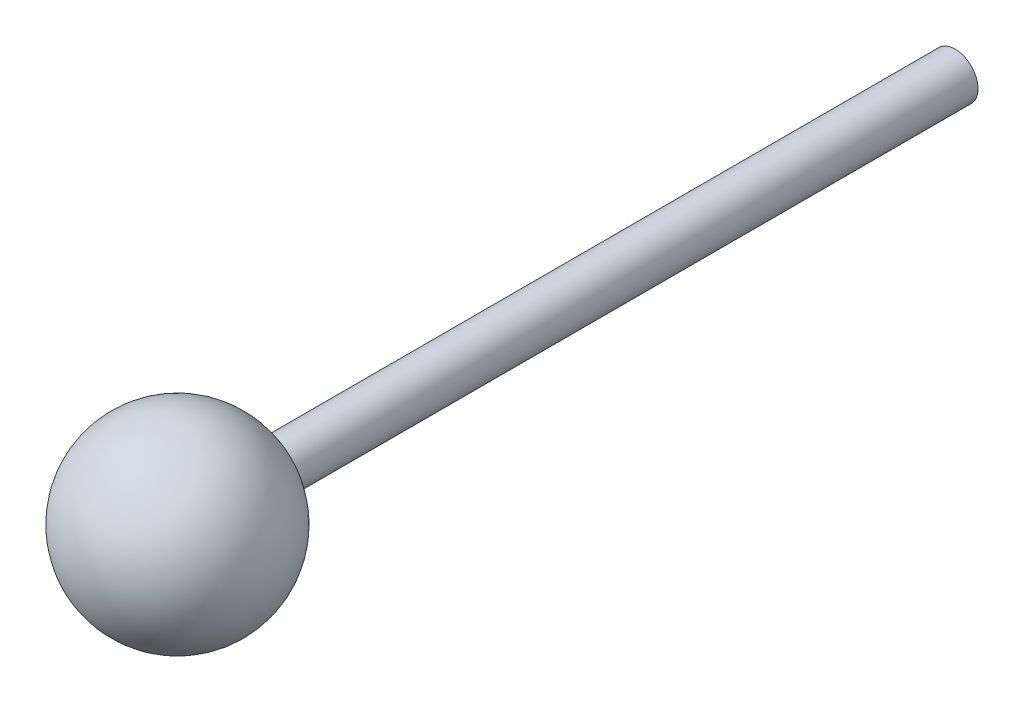
ISO-10303-21;
HEADER;
FILE_DESCRIPTION(('STEP AP214'),'2;1');
FILE_NAME('part.step','',(''),(''),'','','');
FILE_SCHEMA(('AUTOMOTIVE_DESIGN { 1 0 10303 214 1 1 1 1 }'));
ENDSEC;
DATA;
#1=APPLICATION_CONTEXT('core data for automotive mechanical design processes');
#2=APPLICATION_PROTOCOL_DEFINITION('international standard','automotive_design',2000,#1);
#3=PRODUCT_CONTEXT('',#1,'mechanical');
#4=PRODUCT('Part','Part','',(#3));
#5=PRODUCT_RELATED_PRODUCT_CATEGORY('part','',(#4));
#6=PRODUCT_DEFINITION_FORMATION('','',#4);
#7=PRODUCT_DEFINITION_CONTEXT('part definition',#1,'design');
#8=PRODUCT_DEFINITION('design','',#6,#7);
#9=PRODUCT_DEFINITION_SHAPE('','',#8);
#10=(LENGTH_UNIT() NAMED_UNIT(*) SI_UNIT(.MILLI.,.METRE.));
#11=(NAMED_UNIT(*) PLANE_ANGLE_UNIT() SI_UNIT($,.RADIAN.));
#12=(NAMED_UNIT(*) SI_UNIT($,.STERADIAN.) SOLID_ANGLE_UNIT());
#13=UNCERTAINTY_MEASURE_WITH_UNIT(LENGTH_MEASURE(1.E-05),#10,'distance_accuracy_value','');
#14=(GEOMETRIC_REPRESENTATION_CONTEXT(3) GLOBAL_UNCERTAINTY_ASSIGNED_CONTEXT((#13)) GLOBAL_UNIT_ASSIGNED_CONTEXT((#10,
#11,#12)) REPRESENTATION_CONTEXT('',''));
#15=CARTESIAN_POINT('',(0.,0.,0.));
#16=DIRECTION('',(0.,0.,1.));
#17=DIRECTION('',(1.,0.,0.));
#18=AXIS2_PLACEMENT_3D('',#15,#16,#17);
#19=CARTESIAN_POINT('',(67.9041212428615,47.8091782821366,15.));
#20=DIRECTION('',(0.,0.,-1.));
#21=DIRECTION('',(-1.,0.,0.));
#22=AXIS2_PLACEMENT_3D('',#19,#20,#21);
#23=CYLINDRICAL_SURFACE('',#22,0.499999999999999);
#24=CARTESIAN_POINT('',(67.9041212428615,47.8091782821366,15.));
#25=DIRECTION('',(0.,0.,1.));
#26=DIRECTION('',(1.,0.,0.));
#27=AXIS2_PLACEMENT_3D('',#24,#25,#26);
#28=CIRCLE('',#27,0.499999999999999);
#29=CARTESIAN_POINT('',(68.4041212428615,47.8091782821366,15.));
#30=VERTEX_POINT('',#29);
#31=EDGE_CURVE('E10',#30,#30,#28,.T.);
#32=ORIENTED_EDGE('',*,*,#31,.F.);
#33=EDGE_LOOP('',(#32));
#34=FACE_BOUND('',#33,.T.);
#35=CARTESIAN_POINT('',(67.9041212428615,47.8091782821366,0.));
#36=DIRECTION('',(0.,0.,1.));
#37=DIRECTION('',(1.,0.,0.));
#38=AXIS2_PLACEMENT_3D('',#35,#36,#37);
#39=CIRCLE('',#38,0.499999999999999);
#40=CARTESIAN_POINT('',(68.4041212428615,47.8091782821366,0.));
#41=VERTEX_POINT('',#40);
#42=EDGE_CURVE('E41',#41,#41,#39,.T.);
#43=ORIENTED_EDGE('',*,*,#42,.T.);
#44=EDGE_LOOP('',(#43));
#45=FACE_BOUND('',#44,.T.);
#46=ADVANCED_FACE('F34',(#34,#45),#23,.T.);
#47=CARTESIAN_POINT('',(67.9041212428615,47.8091782821366,16.96875));
#48=DIRECTION('',(0.,0.,1.));
#49=DIRECTION('',(1.,0.,0.));
#50=AXIS2_PLACEMENT_3D('',#47,#48,#49);
#51=SPHERICAL_SURFACE('',#50,2.03125);
#52=ORIENTED_EDGE('',*,*,#31,.T.);
#53=EDGE_LOOP('',(#52));
#54=FACE_BOUND('',#53,.T.);
#55=ADVANCED_FACE('F36',(#54),#51,.T.);
#56=CARTESIAN_POINT('',(67.9041212428615,47.8091782821366,0.));
#57=DIRECTION('',(0.,0.,1.));
#58=DIRECTION('',(1.,0.,0.));
#59=AXIS2_PLACEMENT_3D('',#56,#57,#58);
#60=PLANE('',#59);
#61=ORIENTED_EDGE('',*,*,#42,.F.);
#62=EDGE_LOOP('',(#61));
#63=FACE_BOUND('',#62,.T.);
#64=ADVANCED_FACE('F48',(#63),#60,.F.);
#65=CLOSED_SHELL('',(#46,#55,#64));
#66=MANIFOLD_SOLID_BREP('B2',#65);
#67=ADVANCED_BREP_SHAPE_REPRESENTATION('',(#18,#66),#14);
#68=SHAPE_DEFINITION_REPRESENTATION(#9,#67);
ENDSEC;
END-ISO-10303-21;
